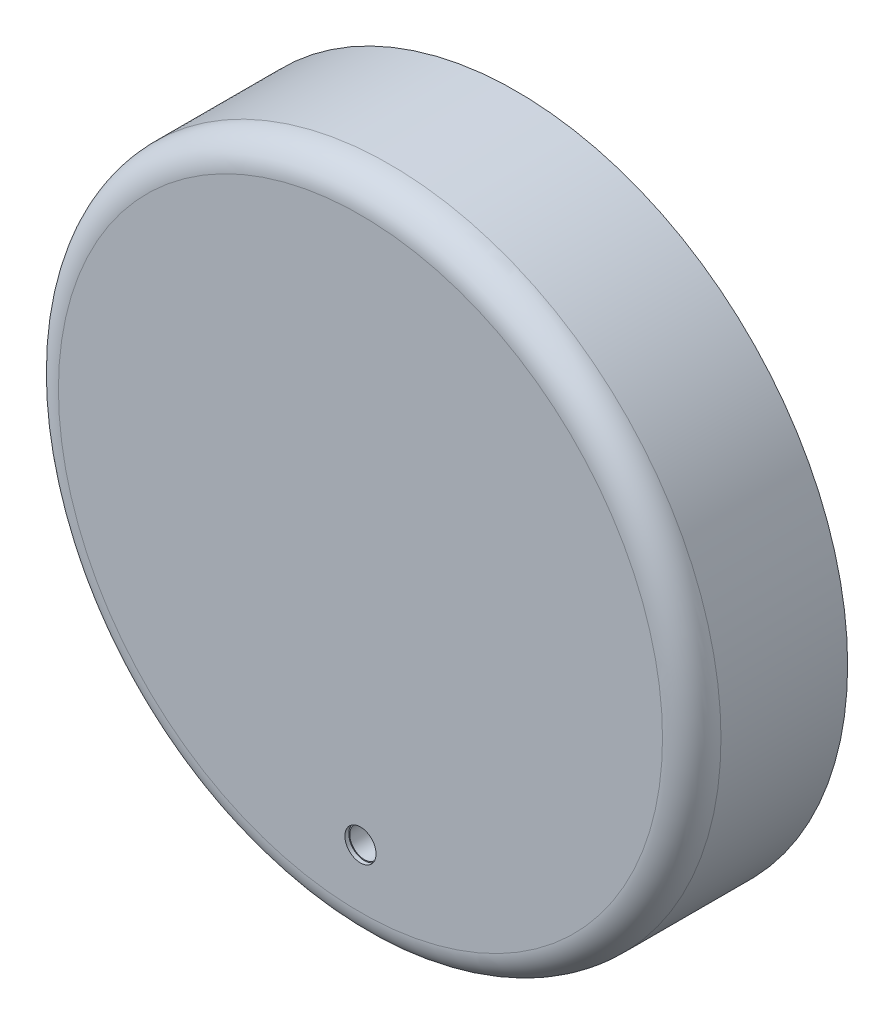
ISO-10303-21;
HEADER;
FILE_DESCRIPTION(('STEP AP214'),'2;1');
FILE_NAME('part.step','',(''),(''),'','','');
FILE_SCHEMA(('AUTOMOTIVE_DESIGN { 1 0 10303 214 1 1 1 1 }'));
ENDSEC;
DATA;
#1=APPLICATION_CONTEXT('core data for automotive mechanical design processes');
#2=APPLICATION_PROTOCOL_DEFINITION('international standard','automotive_design',2000,#1);
#3=PRODUCT_CONTEXT('',#1,'mechanical');
#4=PRODUCT('Part','Part','',(#3));
#5=PRODUCT_RELATED_PRODUCT_CATEGORY('part','',(#4));
#6=PRODUCT_DEFINITION_FORMATION('','',#4);
#7=PRODUCT_DEFINITION_CONTEXT('part definition',#1,'design');
#8=PRODUCT_DEFINITION('design','',#6,#7);
#9=PRODUCT_DEFINITION_SHAPE('','',#8);
#10=(LENGTH_UNIT() NAMED_UNIT(*) SI_UNIT(.MILLI.,.METRE.));
#11=(NAMED_UNIT(*) PLANE_ANGLE_UNIT() SI_UNIT($,.RADIAN.));
#12=(NAMED_UNIT(*) SI_UNIT($,.STERADIAN.) SOLID_ANGLE_UNIT());
#13=UNCERTAINTY_MEASURE_WITH_UNIT(LENGTH_MEASURE(1.E-05),#10,'distance_accuracy_value','');
#14=(GEOMETRIC_REPRESENTATION_CONTEXT(3) GLOBAL_UNCERTAINTY_ASSIGNED_CONTEXT((#13)) GLOBAL_UNIT_ASSIGNED_CONTEXT((#10,
#11,#12)) REPRESENTATION_CONTEXT('',''));
#15=CARTESIAN_POINT('',(0.,0.,0.));
#16=DIRECTION('',(0.,0.,1.));
#17=DIRECTION('',(1.,0.,0.));
#18=AXIS2_PLACEMENT_3D('',#15,#16,#17);
#19=CARTESIAN_POINT('',(0.,0.,13.));
#20=DIRECTION('',(0.,0.,-1.));
#21=DIRECTION('',(-1.,0.,0.));
#22=AXIS2_PLACEMENT_3D('',#19,#20,#21);
#23=CYLINDRICAL_SURFACE('',#22,31.5);
#24=CARTESIAN_POINT('',(0.,0.,13.));
#25=DIRECTION('',(0.,0.,1.));
#26=DIRECTION('',(1.,0.,0.));
#27=AXIS2_PLACEMENT_3D('',#24,#25,#26);
#28=CIRCLE('',#27,31.5);
#29=CARTESIAN_POINT('',(31.5,0.,13.));
#30=VERTEX_POINT('',#29);
#31=EDGE_CURVE('E54',#30,#30,#28,.T.);
#32=ORIENTED_EDGE('',*,*,#31,.T.);
#33=EDGE_LOOP('',(#32));
#34=FACE_BOUND('',#33,.T.);
#35=CARTESIAN_POINT('',(0.,0.,3.));
#36=DIRECTION('',(0.,0.,-1.));
#37=DIRECTION('',(-1.,0.,0.));
#38=AXIS2_PLACEMENT_3D('',#35,#36,#37);
#39=CIRCLE('',#38,31.5);
#40=CARTESIAN_POINT('',(-31.5,0.,3.));
#41=VERTEX_POINT('',#40);
#42=EDGE_CURVE('E79',#41,#41,#39,.T.);
#43=ORIENTED_EDGE('',*,*,#42,.T.);
#44=EDGE_LOOP('',(#43));
#45=FACE_BOUND('',#44,.T.);
#46=ADVANCED_FACE('F31',(#34,#45),#23,.F.);
#47=CARTESIAN_POINT('',(0.,0.,13.));
#48=DIRECTION('',(0.,0.,1.));
#49=DIRECTION('',(1.,0.,0.));
#50=AXIS2_PLACEMENT_3D('',#47,#48,#49);
#51=PLANE('',#50);
#52=CARTESIAN_POINT('',(0.,-25.,13.));
#53=DIRECTION('',(0.,0.,1.));
#54=DIRECTION('',(1.,0.,0.));
#55=AXIS2_PLACEMENT_3D('',#52,#53,#54);
#56=CIRCLE('',#55,1.5);
#57=CARTESIAN_POINT('',(1.5,-25.,13.));
#58=VERTEX_POINT('',#57);
#59=EDGE_CURVE('E35',#58,#58,#56,.T.);
#60=ORIENTED_EDGE('',*,*,#59,.T.);
#61=EDGE_LOOP('',(#60));
#62=FACE_BOUND('',#61,.T.);
#63=CARTESIAN_POINT('',(-20.,0.,13.));
#64=DIRECTION('',(0.,0.,1.));
#65=DIRECTION('',(1.,0.,0.));
#66=AXIS2_PLACEMENT_3D('',#63,#64,#65);
#67=CIRCLE('',#66,2.5);
#68=CARTESIAN_POINT('',(-17.5,0.,13.));
#69=VERTEX_POINT('',#68);
#70=EDGE_CURVE('E10',#69,#69,#67,.F.);
#71=ORIENTED_EDGE('',*,*,#70,.F.);
#72=EDGE_LOOP('',(#71));
#73=FACE_BOUND('',#72,.T.);
#74=CARTESIAN_POINT('',(20.,0.,13.));
#75=DIRECTION('',(0.,0.,1.));
#76=DIRECTION('',(1.,0.,0.));
#77=AXIS2_PLACEMENT_3D('',#74,#75,#76);
#78=CIRCLE('',#77,2.5);
#79=CARTESIAN_POINT('',(22.5,0.,13.));
#80=VERTEX_POINT('',#79);
#81=EDGE_CURVE('E39',#80,#80,#78,.F.);
#82=ORIENTED_EDGE('',*,*,#81,.F.);
#83=EDGE_LOOP('',(#82));
#84=FACE_BOUND('',#83,.T.);
#85=ORIENTED_EDGE('',*,*,#31,.F.);
#86=EDGE_LOOP('',(#85));
#87=FACE_BOUND('',#86,.T.);
#88=ADVANCED_FACE('F97',(#62,#73,#84,#87),#51,.F.);
#89=CARTESIAN_POINT('',(20.,0.,3.));
#90=DIRECTION('',(0.,0.,-1.));
#91=DIRECTION('',(-1.,0.,0.));
#92=AXIS2_PLACEMENT_3D('',#89,#90,#91);
#93=PLANE('',#92);
#94=CARTESIAN_POINT('',(20.,0.,3.));
#95=DIRECTION('',(0.,0.,-1.));
#96=DIRECTION('',(-1.,0.,0.));
#97=AXIS2_PLACEMENT_3D('',#94,#95,#96);
#98=CIRCLE('',#97,2.5);
#99=CARTESIAN_POINT('',(17.5,0.,3.));
#100=VERTEX_POINT('',#99);
#101=EDGE_CURVE('E57',#100,#100,#98,.T.);
#102=ORIENTED_EDGE('',*,*,#101,.T.);
#103=EDGE_LOOP('',(#102));
#104=FACE_BOUND('',#103,.T.);
#105=CARTESIAN_POINT('',(20.,0.,3.));
#106=DIRECTION('',(0.,0.,-1.));
#107=DIRECTION('',(-1.,0.,0.));
#108=AXIS2_PLACEMENT_3D('',#105,#106,#107);
#109=CIRCLE('',#108,1.5);
#110=CARTESIAN_POINT('',(18.5,0.,3.));
#111=VERTEX_POINT('',#110);
#112=EDGE_CURVE('E60',#111,#111,#109,.T.);
#113=ORIENTED_EDGE('',*,*,#112,.F.);
#114=EDGE_LOOP('',(#113));
#115=FACE_BOUND('',#114,.T.);
#116=ADVANCED_FACE('F116',(#104,#115),#93,.T.);
#117=CARTESIAN_POINT('',(20.,0.,3.));
#118=DIRECTION('',(0.,0.,1.));
#119=DIRECTION('',(1.,0.,0.));
#120=AXIS2_PLACEMENT_3D('',#117,#118,#119);
#121=CYLINDRICAL_SURFACE('',#120,2.5);
#122=ORIENTED_EDGE('',*,*,#101,.F.);
#123=EDGE_LOOP('',(#122));
#124=FACE_BOUND('',#123,.T.);
#125=ORIENTED_EDGE('',*,*,#81,.T.);
#126=EDGE_LOOP('',(#125));
#127=FACE_BOUND('',#126,.T.);
#128=ADVANCED_FACE('F152',(#124,#127),#121,.T.);
#129=CARTESIAN_POINT('',(20.,0.,3.));
#130=DIRECTION('',(0.,0.,1.));
#131=DIRECTION('',(1.,0.,0.));
#132=AXIS2_PLACEMENT_3D('',#129,#130,#131);
#133=CYLINDRICAL_SURFACE('',#132,1.5);
#134=ORIENTED_EDGE('',*,*,#112,.T.);
#135=EDGE_LOOP('',(#134));
#136=FACE_BOUND('',#135,.T.);
#137=CARTESIAN_POINT('',(20.,0.,13.));
#138=DIRECTION('',(0.,0.,-1.));
#139=DIRECTION('',(-1.,0.,0.));
#140=AXIS2_PLACEMENT_3D('',#137,#138,#139);
#141=CIRCLE('',#140,1.5);
#142=CARTESIAN_POINT('',(18.5,0.,13.));
#143=VERTEX_POINT('',#142);
#144=EDGE_CURVE('E61',#143,#143,#141,.T.);
#145=ORIENTED_EDGE('',*,*,#144,.F.);
#146=EDGE_LOOP('',(#145));
#147=FACE_BOUND('',#146,.T.);
#148=ADVANCED_FACE('F155',(#136,#147),#133,.F.);
#149=ORIENTED_EDGE('',*,*,#144,.T.);
#150=EDGE_LOOP('',(#149));
#151=FACE_BOUND('',#150,.T.);
#152=ADVANCED_FACE('F119',(#151),#51,.F.);
#153=CARTESIAN_POINT('',(-20.,0.,3.));
#154=DIRECTION('',(0.,0.,-1.));
#155=DIRECTION('',(-1.,0.,0.));
#156=AXIS2_PLACEMENT_3D('',#153,#154,#155);
#157=PLANE('',#156);
#158=CARTESIAN_POINT('',(-20.,0.,3.));
#159=DIRECTION('',(0.,0.,-1.));
#160=DIRECTION('',(-1.,0.,0.));
#161=AXIS2_PLACEMENT_3D('',#158,#159,#160);
#162=CIRCLE('',#161,2.5);
#163=CARTESIAN_POINT('',(-22.5,0.,3.));
#164=VERTEX_POINT('',#163);
#165=EDGE_CURVE('E64',#164,#164,#162,.T.);
#166=ORIENTED_EDGE('',*,*,#165,.T.);
#167=EDGE_LOOP('',(#166));
#168=FACE_BOUND('',#167,.T.);
#169=CARTESIAN_POINT('',(-20.,0.,3.));
#170=DIRECTION('',(0.,0.,-1.));
#171=DIRECTION('',(-1.,0.,0.));
#172=AXIS2_PLACEMENT_3D('',#169,#170,#171);
#173=CIRCLE('',#172,1.5);
#174=CARTESIAN_POINT('',(-21.5,0.,3.));
#175=VERTEX_POINT('',#174);
#176=EDGE_CURVE('E69',#175,#175,#173,.T.);
#177=ORIENTED_EDGE('',*,*,#176,.F.);
#178=EDGE_LOOP('',(#177));
#179=FACE_BOUND('',#178,.T.);
#180=ADVANCED_FACE('F167',(#168,#179),#157,.T.);
#181=CARTESIAN_POINT('',(-20.,0.,3.));
#182=DIRECTION('',(0.,0.,1.));
#183=DIRECTION('',(1.,0.,0.));
#184=AXIS2_PLACEMENT_3D('',#181,#182,#183);
#185=CYLINDRICAL_SURFACE('',#184,2.5);
#186=ORIENTED_EDGE('',*,*,#165,.F.);
#187=EDGE_LOOP('',(#186));
#188=FACE_BOUND('',#187,.T.);
#189=ORIENTED_EDGE('',*,*,#70,.T.);
#190=EDGE_LOOP('',(#189));
#191=FACE_BOUND('',#190,.T.);
#192=ADVANCED_FACE('F163',(#188,#191),#185,.T.);
#193=CARTESIAN_POINT('',(-20.,0.,3.));
#194=DIRECTION('',(0.,0.,1.));
#195=DIRECTION('',(1.,0.,0.));
#196=AXIS2_PLACEMENT_3D('',#193,#194,#195);
#197=CYLINDRICAL_SURFACE('',#196,1.5);
#198=ORIENTED_EDGE('',*,*,#176,.T.);
#199=EDGE_LOOP('',(#198));
#200=FACE_BOUND('',#199,.T.);
#201=CARTESIAN_POINT('',(-20.,0.,13.));
#202=DIRECTION('',(0.,0.,-1.));
#203=DIRECTION('',(-1.,0.,0.));
#204=AXIS2_PLACEMENT_3D('',#201,#202,#203);
#205=CIRCLE('',#204,1.5);
#206=CARTESIAN_POINT('',(-21.5,0.,13.));
#207=VERTEX_POINT('',#206);
#208=EDGE_CURVE('E70',#207,#207,#205,.T.);
#209=ORIENTED_EDGE('',*,*,#208,.F.);
#210=EDGE_LOOP('',(#209));
#211=FACE_BOUND('',#210,.T.);
#212=ADVANCED_FACE('F166',(#200,#211),#197,.F.);
#213=ORIENTED_EDGE('',*,*,#208,.T.);
#214=EDGE_LOOP('',(#213));
#215=FACE_BOUND('',#214,.T.);
#216=ADVANCED_FACE('F118',(#215),#51,.F.);
#217=CARTESIAN_POINT('',(0.,0.,3.));
#218=DIRECTION('',(0.,0.,-1.));
#219=DIRECTION('',(-1.,0.,0.));
#220=AXIS2_PLACEMENT_3D('',#217,#218,#219);
#221=CYLINDRICAL_SURFACE('',#220,32.5);
#222=CARTESIAN_POINT('',(0.,0.,3.));
#223=DIRECTION('',(0.,0.,-1.));
#224=DIRECTION('',(-1.,0.,0.));
#225=AXIS2_PLACEMENT_3D('',#222,#223,#224);
#226=CIRCLE('',#225,32.5);
#227=CARTESIAN_POINT('',(-32.5,0.,3.));
#228=VERTEX_POINT('',#227);
#229=EDGE_CURVE('E73',#228,#228,#226,.T.);
#230=ORIENTED_EDGE('',*,*,#229,.F.);
#231=EDGE_LOOP('',(#230));
#232=FACE_BOUND('',#231,.T.);
#233=CARTESIAN_POINT('',(0.,0.,0.));
#234=DIRECTION('',(0.,0.,-1.));
#235=DIRECTION('',(-1.,0.,0.));
#236=AXIS2_PLACEMENT_3D('',#233,#234,#235);
#237=CIRCLE('',#236,32.5);
#238=CARTESIAN_POINT('',(-32.5,0.,0.));
#239=VERTEX_POINT('',#238);
#240=EDGE_CURVE('E76',#239,#239,#237,.T.);
#241=ORIENTED_EDGE('',*,*,#240,.T.);
#242=EDGE_LOOP('',(#241));
#243=FACE_BOUND('',#242,.T.);
#244=ADVANCED_FACE('F147',(#232,#243),#221,.F.);
#245=CARTESIAN_POINT('',(0.,0.,3.));
#246=DIRECTION('',(0.,0.,-1.));
#247=DIRECTION('',(-1.,0.,0.));
#248=AXIS2_PLACEMENT_3D('',#245,#246,#247);
#249=PLANE('',#248);
#250=ORIENTED_EDGE('',*,*,#42,.F.);
#251=EDGE_LOOP('',(#250));
#252=FACE_BOUND('',#251,.T.);
#253=ORIENTED_EDGE('',*,*,#229,.T.);
#254=EDGE_LOOP('',(#253));
#255=FACE_BOUND('',#254,.T.);
#256=ADVANCED_FACE('F142',(#252,#255),#249,.T.);
#257=CARTESIAN_POINT('',(0.,0.,16.));
#258=DIRECTION('',(0.,0.,1.));
#259=DIRECTION('',(1.,0.,0.));
#260=AXIS2_PLACEMENT_3D('',#257,#258,#259);
#261=PLANE('',#260);
#262=CARTESIAN_POINT('',(0.,-25.,16.));
#263=DIRECTION('',(0.,0.,1.));
#264=DIRECTION('',(1.,0.,0.));
#265=AXIS2_PLACEMENT_3D('',#262,#263,#264);
#266=CIRCLE('',#265,1.6);
#267=CARTESIAN_POINT('',(1.6,-25.,16.));
#268=VERTEX_POINT('',#267);
#269=EDGE_CURVE('E85',#268,#268,#266,.T.);
#270=ORIENTED_EDGE('',*,*,#269,.F.);
#271=EDGE_LOOP('',(#270));
#272=FACE_BOUND('',#271,.T.);
#273=CARTESIAN_POINT('',(0.,0.,16.));
#274=DIRECTION('',(0.,0.,1.));
#275=DIRECTION('',(1.,0.,0.));
#276=AXIS2_PLACEMENT_3D('',#273,#274,#275);
#277=CIRCLE('',#276,31.);
#278=CARTESIAN_POINT('',(31.,0.,16.));
#279=VERTEX_POINT('',#278);
#280=EDGE_CURVE('E48',#279,#279,#277,.T.);
#281=ORIENTED_EDGE('',*,*,#280,.T.);
#282=EDGE_LOOP('',(#281));
#283=FACE_BOUND('',#282,.T.);
#284=ADVANCED_FACE('F132',(#272,#283),#261,.T.);
#285=CARTESIAN_POINT('',(0.,0.,13.));
#286=DIRECTION('',(0.,0.,1.));
#287=DIRECTION('',(1.,0.,0.));
#288=AXIS2_PLACEMENT_3D('',#285,#286,#287);
#289=TOROIDAL_SURFACE('',#288,31.,3.);
#290=CARTESIAN_POINT('',(0.,0.,13.));
#291=DIRECTION('',(0.,0.,1.));
#292=DIRECTION('',(1.,0.,0.));
#293=AXIS2_PLACEMENT_3D('',#290,#291,#292);
#294=CIRCLE('',#293,34.);
#295=CARTESIAN_POINT('',(34.,0.,13.));
#296=VERTEX_POINT('',#295);
#297=EDGE_CURVE('E43',#296,#296,#294,.F.);
#298=ORIENTED_EDGE('',*,*,#297,.F.);
#299=EDGE_LOOP('',(#298));
#300=FACE_BOUND('',#299,.T.);
#301=ORIENTED_EDGE('',*,*,#280,.F.);
#302=EDGE_LOOP('',(#301));
#303=FACE_BOUND('',#302,.T.);
#304=ADVANCED_FACE('F33',(#300,#303),#289,.T.);
#305=CARTESIAN_POINT('',(0.,0.,13.));
#306=DIRECTION('',(0.,0.,-1.));
#307=DIRECTION('',(-1.,0.,0.));
#308=AXIS2_PLACEMENT_3D('',#305,#306,#307);
#309=CYLINDRICAL_SURFACE('',#308,34.);
#310=ORIENTED_EDGE('',*,*,#297,.T.);
#311=EDGE_LOOP('',(#310));
#312=FACE_BOUND('',#311,.T.);
#313=CARTESIAN_POINT('',(0.,0.,0.));
#314=DIRECTION('',(0.,0.,1.));
#315=DIRECTION('',(1.,0.,0.));
#316=AXIS2_PLACEMENT_3D('',#313,#314,#315);
#317=CIRCLE('',#316,34.);
#318=CARTESIAN_POINT('',(34.,0.,0.));
#319=VERTEX_POINT('',#318);
#320=EDGE_CURVE('E51',#319,#319,#317,.T.);
#321=ORIENTED_EDGE('',*,*,#320,.T.);
#322=EDGE_LOOP('',(#321));
#323=FACE_BOUND('',#322,.T.);
#324=ADVANCED_FACE('F125',(#312,#323),#309,.T.);
#325=CARTESIAN_POINT('',(0.,0.,0.));
#326=DIRECTION('',(0.,0.,1.));
#327=DIRECTION('',(1.,0.,0.));
#328=AXIS2_PLACEMENT_3D('',#325,#326,#327);
#329=PLANE('',#328);
#330=ORIENTED_EDGE('',*,*,#240,.F.);
#331=EDGE_LOOP('',(#330));
#332=FACE_BOUND('',#331,.T.);
#333=ORIENTED_EDGE('',*,*,#320,.F.);
#334=EDGE_LOOP('',(#333));
#335=FACE_BOUND('',#334,.T.);
#336=ADVANCED_FACE('F123',(#332,#335),#329,.F.);
#337=CARTESIAN_POINT('',(0.,-25.,15.6));
#338=DIRECTION('',(0.,0.,1.));
#339=DIRECTION('',(1.,0.,0.));
#340=AXIS2_PLACEMENT_3D('',#337,#338,#339);
#341=CYLINDRICAL_SURFACE('',#340,1.6);
#342=CARTESIAN_POINT('',(0.,-25.,15.6));
#343=DIRECTION('',(0.,0.,1.));
#344=DIRECTION('',(1.,0.,0.));
#345=AXIS2_PLACEMENT_3D('',#342,#343,#344);
#346=CIRCLE('',#345,1.6);
#347=CARTESIAN_POINT('',(1.6,-25.,15.6));
#348=VERTEX_POINT('',#347);
#349=EDGE_CURVE('E84',#348,#348,#346,.T.);
#350=ORIENTED_EDGE('',*,*,#349,.F.);
#351=EDGE_LOOP('',(#350));
#352=FACE_BOUND('',#351,.T.);
#353=ORIENTED_EDGE('',*,*,#269,.T.);
#354=EDGE_LOOP('',(#353));
#355=FACE_BOUND('',#354,.T.);
#356=ADVANCED_FACE('F107',(#352,#355),#341,.F.);
#357=CARTESIAN_POINT('',(0.,-25.,15.6));
#358=DIRECTION('',(0.,0.,1.));
#359=DIRECTION('',(1.,0.,0.));
#360=AXIS2_PLACEMENT_3D('',#357,#358,#359);
#361=PLANE('',#360);
#362=CARTESIAN_POINT('',(0.,-25.,15.6));
#363=DIRECTION('',(0.,0.,1.));
#364=DIRECTION('',(1.,0.,0.));
#365=AXIS2_PLACEMENT_3D('',#362,#363,#364);
#366=CIRCLE('',#365,1.5);
#367=CARTESIAN_POINT('',(1.5,-25.,15.6));
#368=VERTEX_POINT('',#367);
#369=EDGE_CURVE('E90',#368,#368,#366,.T.);
#370=ORIENTED_EDGE('',*,*,#369,.F.);
#371=EDGE_LOOP('',(#370));
#372=FACE_BOUND('',#371,.T.);
#373=ORIENTED_EDGE('',*,*,#349,.T.);
#374=EDGE_LOOP('',(#373));
#375=FACE_BOUND('',#374,.T.);
#376=ADVANCED_FACE('F102',(#372,#375),#361,.T.);
#377=CARTESIAN_POINT('',(0.,-25.,0.));
#378=DIRECTION('',(0.,0.,1.));
#379=DIRECTION('',(1.,0.,0.));
#380=AXIS2_PLACEMENT_3D('',#377,#378,#379);
#381=CYLINDRICAL_SURFACE('',#380,1.5);
#382=ORIENTED_EDGE('',*,*,#369,.T.);
#383=EDGE_LOOP('',(#382));
#384=FACE_BOUND('',#383,.T.);
#385=ORIENTED_EDGE('',*,*,#59,.F.);
#386=EDGE_LOOP('',(#385));
#387=FACE_BOUND('',#386,.T.);
#388=ADVANCED_FACE('F100',(#384,#387),#381,.F.);
#389=CLOSED_SHELL('',(#46,#88,#116,#128,#148,#152,#180,#192,#212,#216,#244,#256,#284,#304,#324,
#336,#356,#376,#388));
#390=MANIFOLD_SOLID_BREP('B2',#389);
#391=ADVANCED_BREP_SHAPE_REPRESENTATION('',(#18,#390),#14);
#392=SHAPE_DEFINITION_REPRESENTATION(#9,#391);
ENDSEC;
END-ISO-10303-21;
